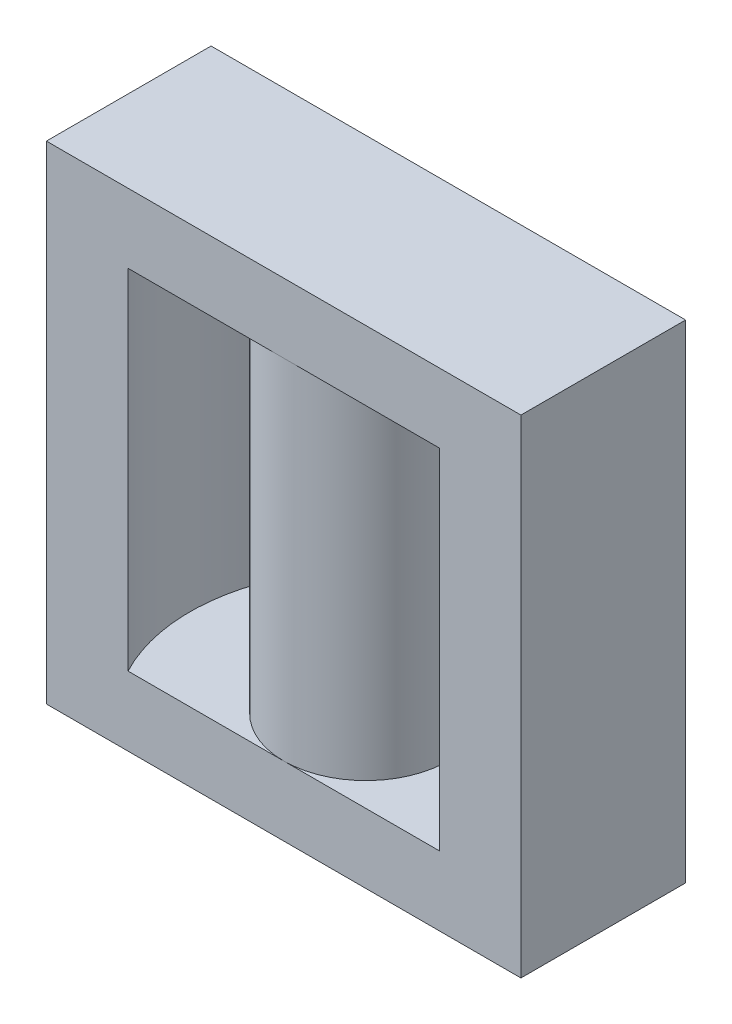
ISO-10303-21;
HEADER;
FILE_DESCRIPTION(('STEP AP214'),'2;1');
FILE_NAME('part.step','',(''),(''),'','','');
FILE_SCHEMA(('AUTOMOTIVE_DESIGN { 1 0 10303 214 1 1 1 1 }'));
ENDSEC;
DATA;
#1=APPLICATION_CONTEXT('core data for automotive mechanical design processes');
#2=APPLICATION_PROTOCOL_DEFINITION('international standard','automotive_design',2000,#1);
#3=PRODUCT_CONTEXT('',#1,'mechanical');
#4=PRODUCT('Part','Part','',(#3));
#5=PRODUCT_RELATED_PRODUCT_CATEGORY('part','',(#4));
#6=PRODUCT_DEFINITION_FORMATION('','',#4);
#7=PRODUCT_DEFINITION_CONTEXT('part definition',#1,'design');
#8=PRODUCT_DEFINITION('design','',#6,#7);
#9=PRODUCT_DEFINITION_SHAPE('','',#8);
#10=(LENGTH_UNIT() NAMED_UNIT(*) SI_UNIT(.MILLI.,.METRE.));
#11=(NAMED_UNIT(*) PLANE_ANGLE_UNIT() SI_UNIT($,.RADIAN.));
#12=(NAMED_UNIT(*) SI_UNIT($,.STERADIAN.) SOLID_ANGLE_UNIT());
#13=UNCERTAINTY_MEASURE_WITH_UNIT(LENGTH_MEASURE(1.E-05),#10,'distance_accuracy_value','');
#14=(GEOMETRIC_REPRESENTATION_CONTEXT(3) GLOBAL_UNCERTAINTY_ASSIGNED_CONTEXT((#13)) GLOBAL_UNIT_ASSIGNED_CONTEXT((#10,
#11,#12)) REPRESENTATION_CONTEXT('',''));
#15=CARTESIAN_POINT('',(0.,0.,0.));
#16=DIRECTION('',(0.,0.,1.));
#17=DIRECTION('',(1.,0.,0.));
#18=AXIS2_PLACEMENT_3D('',#15,#16,#17);
#19=CARTESIAN_POINT('',(-129.478947368421,45.,-367.005263157895));
#20=DIRECTION('',(0.,-1.,0.));
#21=DIRECTION('',(0.,0.,-1.));
#22=AXIS2_PLACEMENT_3D('',#19,#20,#21);
#23=CYLINDRICAL_SURFACE('',#22,16.25);
#24=DIRECTION('',(0.,-1.,0.));
#25=VECTOR('',#24,1.);
#26=CARTESIAN_POINT('',(-115.115713052989,45.,-359.405263157895));
#27=LINE('',#26,#25);
#28=CARTESIAN_POINT('',(-115.115713052989,38.6,-359.405263157895));
#29=VERTEX_POINT('',#28);
#30=CARTESIAN_POINT('',(-115.115713052989,6.4,-359.405263157895));
#31=VERTEX_POINT('',#30);
#32=EDGE_CURVE('E51',#29,#31,#27,.T.);
#33=ORIENTED_EDGE('',*,*,#32,.F.);
#34=CARTESIAN_POINT('',(-129.478947368421,38.6,-367.005263157895));
#35=DIRECTION('',(0.,1.,0.));
#36=DIRECTION('',(0.,0.,1.));
#37=AXIS2_PLACEMENT_3D('',#34,#35,#36);
#38=CIRCLE('',#37,16.25);
#39=CARTESIAN_POINT('',(-115.115713052989,38.6,-374.605263157895));
#40=VERTEX_POINT('',#39);
#41=EDGE_CURVE('E55',#29,#40,#38,.T.);
#42=ORIENTED_EDGE('',*,*,#41,.T.);
#43=DIRECTION('',(0.,-1.,0.));
#44=VECTOR('',#43,1.);
#45=CARTESIAN_POINT('',(-115.115713052989,45.,-374.605263157895));
#46=LINE('',#45,#44);
#47=CARTESIAN_POINT('',(-115.115713052989,6.4,-374.605263157895));
#48=VERTEX_POINT('',#47);
#49=EDGE_CURVE('E176',#40,#48,#46,.T.);
#50=ORIENTED_EDGE('',*,*,#49,.T.);
#51=CARTESIAN_POINT('',(-129.478947368421,6.4,-367.005263157895));
#52=DIRECTION('',(0.,1.,0.));
#53=DIRECTION('',(0.,0.,1.));
#54=AXIS2_PLACEMENT_3D('',#51,#52,#53);
#55=CIRCLE('',#54,16.25);
#56=EDGE_CURVE('E163',#31,#48,#55,.T.);
#57=ORIENTED_EDGE('',*,*,#56,.F.);
#58=EDGE_LOOP('',(#33,#42,#50,#57));
#59=FACE_BOUND('',#58,.T.);
#60=ADVANCED_FACE('F37',(#59),#23,.F.);
#61=CARTESIAN_POINT('',(-129.478947368421,45.,-367.005263157895));
#62=DIRECTION('',(0.,-1.,0.));
#63=DIRECTION('',(0.,0.,-1.));
#64=AXIS2_PLACEMENT_3D('',#61,#62,#63);
#65=CYLINDRICAL_SURFACE('',#64,7.59999999999999);
#66=CARTESIAN_POINT('',(-129.478947368421,6.4,-367.005263157895));
#67=DIRECTION('',(0.,1.,0.));
#68=DIRECTION('',(0.,0.,1.));
#69=AXIS2_PLACEMENT_3D('',#66,#67,#68);
#70=CIRCLE('',#69,7.59999999999999);
#71=CARTESIAN_POINT('',(-129.478947368421,6.4,-359.405263157895));
#72=VERTEX_POINT('',#71);
#73=CARTESIAN_POINT('',(-129.478947368421,6.4,-374.605263157895));
#74=VERTEX_POINT('',#73);
#75=EDGE_CURVE('E44',#72,#74,#70,.F.);
#76=ORIENTED_EDGE('',*,*,#75,.F.);
#77=EDGE_CURVE('E189',#74,#72,#70,.F.);
#78=ORIENTED_EDGE('',*,*,#77,.F.);
#79=EDGE_LOOP('',(#76,#78));
#80=FACE_BOUND('',#79,.T.);
#81=CARTESIAN_POINT('',(-129.478947368421,38.6,-367.005263157895));
#82=DIRECTION('',(0.,1.,0.));
#83=DIRECTION('',(0.,0.,1.));
#84=AXIS2_PLACEMENT_3D('',#81,#82,#83);
#85=CIRCLE('',#84,7.59999999999999);
#86=CARTESIAN_POINT('',(-129.478947368421,38.6,-359.405263157895));
#87=VERTEX_POINT('',#86);
#88=CARTESIAN_POINT('',(-129.478947368421,38.6,-374.605263157895));
#89=VERTEX_POINT('',#88);
#90=EDGE_CURVE('E109',#87,#89,#85,.T.);
#91=ORIENTED_EDGE('',*,*,#90,.F.);
#92=EDGE_CURVE('E112',#89,#87,#85,.T.);
#93=ORIENTED_EDGE('',*,*,#92,.F.);
#94=EDGE_LOOP('',(#91,#93));
#95=FACE_BOUND('',#94,.T.);
#96=ADVANCED_FACE('F111',(#80,#95),#65,.T.);
#97=CARTESIAN_POINT('',(-129.478947368421,45.,-367.005263157895));
#98=DIRECTION('',(0.,-1.,0.));
#99=DIRECTION('',(0.,0.,-1.));
#100=AXIS2_PLACEMENT_3D('',#97,#98,#99);
#101=CYLINDRICAL_SURFACE('',#100,16.25);
#102=DIRECTION('',(0.,-1.,0.));
#103=VECTOR('',#102,1.);
#104=CARTESIAN_POINT('',(-143.842181683853,45.,-374.605263157895));
#105=LINE('',#104,#103);
#106=CARTESIAN_POINT('',(-143.842181683853,38.6,-374.605263157895));
#107=VERTEX_POINT('',#106);
#108=CARTESIAN_POINT('',(-143.842181683853,6.4,-374.605263157895));
#109=VERTEX_POINT('',#108);
#110=EDGE_CURVE('E145',#107,#109,#105,.T.);
#111=ORIENTED_EDGE('',*,*,#110,.F.);
#112=CARTESIAN_POINT('',(-129.478947368421,38.6,-367.005263157895));
#113=DIRECTION('',(0.,1.,0.));
#114=DIRECTION('',(0.,0.,1.));
#115=AXIS2_PLACEMENT_3D('',#112,#113,#114);
#116=CIRCLE('',#115,16.25);
#117=CARTESIAN_POINT('',(-143.842181683853,38.6,-359.405263157895));
#118=VERTEX_POINT('',#117);
#119=EDGE_CURVE('E11',#107,#118,#116,.T.);
#120=ORIENTED_EDGE('',*,*,#119,.T.);
#121=DIRECTION('',(0.,-1.,0.));
#122=VECTOR('',#121,1.);
#123=CARTESIAN_POINT('',(-143.842181683853,45.,-359.405263157895));
#124=LINE('',#123,#122);
#125=CARTESIAN_POINT('',(-143.842181683853,6.40000000000002,-359.405263157895));
#126=VERTEX_POINT('',#125);
#127=EDGE_CURVE('E137',#118,#126,#124,.T.);
#128=ORIENTED_EDGE('',*,*,#127,.T.);
#129=CARTESIAN_POINT('',(-129.478947368421,6.4,-367.005263157895));
#130=DIRECTION('',(0.,1.,0.));
#131=DIRECTION('',(0.,0.,1.));
#132=AXIS2_PLACEMENT_3D('',#129,#130,#131);
#133=CIRCLE('',#132,16.25);
#134=EDGE_CURVE('E147',#126,#109,#133,.F.);
#135=ORIENTED_EDGE('',*,*,#134,.T.);
#136=EDGE_LOOP('',(#111,#120,#128,#135));
#137=FACE_BOUND('',#136,.T.);
#138=ADVANCED_FACE('F209',(#137),#101,.F.);
#139=CARTESIAN_POINT('',(0.,6.4,0.));
#140=DIRECTION('',(0.,1.,0.));
#141=DIRECTION('',(0.,0.,1.));
#142=AXIS2_PLACEMENT_3D('',#139,#140,#141);
#143=PLANE('',#142);
#144=ORIENTED_EDGE('',*,*,#134,.F.);
#145=DIRECTION('',(1.,0.,0.));
#146=VECTOR('',#145,1.);
#147=CARTESIAN_POINT('',(0.,6.4,-359.405263157895));
#148=LINE('',#147,#146);
#149=EDGE_CURVE('E151',#126,#72,#148,.T.);
#150=ORIENTED_EDGE('',*,*,#149,.T.);
#151=ORIENTED_EDGE('',*,*,#75,.T.);
#152=DIRECTION('',(1.,0.,0.));
#153=VECTOR('',#152,1.);
#154=CARTESIAN_POINT('',(0.,6.4,-374.605263157895));
#155=LINE('',#154,#153);
#156=EDGE_CURVE('E155',#109,#74,#155,.T.);
#157=ORIENTED_EDGE('',*,*,#156,.F.);
#158=EDGE_LOOP('',(#144,#150,#151,#157));
#159=FACE_BOUND('',#158,.T.);
#160=ADVANCED_FACE('F201',(#159),#143,.T.);
#161=CARTESIAN_POINT('',(0.,45.,-359.405263157895));
#162=DIRECTION('',(0.,0.,-1.));
#163=DIRECTION('',(-1.,0.,0.));
#164=AXIS2_PLACEMENT_3D('',#161,#162,#163);
#165=PLANE('',#164);
#166=DIRECTION('',(1.,0.,0.));
#167=VECTOR('',#166,1.);
#168=CARTESIAN_POINT('',(-151.378947368421,38.6,-359.405263157895));
#169=LINE('',#168,#167);
#170=EDGE_CURVE('E129',#87,#29,#169,.T.);
#171=ORIENTED_EDGE('',*,*,#170,.T.);
#172=ORIENTED_EDGE('',*,*,#32,.T.);
#173=EDGE_CURVE('E154',#72,#31,#148,.T.);
#174=ORIENTED_EDGE('',*,*,#173,.F.);
#175=ORIENTED_EDGE('',*,*,#149,.F.);
#176=ORIENTED_EDGE('',*,*,#127,.F.);
#177=EDGE_CURVE('E123',#118,#87,#169,.T.);
#178=ORIENTED_EDGE('',*,*,#177,.T.);
#179=EDGE_LOOP('',(#171,#172,#174,#175,#176,#178));
#180=FACE_BOUND('',#179,.T.);
#181=DIRECTION('',(1.,0.,0.));
#182=VECTOR('',#181,1.);
#183=CARTESIAN_POINT('',(0.,45.,-359.405263157895));
#184=LINE('',#183,#182);
#185=CARTESIAN_POINT('',(-151.378947368421,45.,-359.405263157895));
#186=VERTEX_POINT('',#185);
#187=CARTESIAN_POINT('',(-107.578947368421,45.,-359.405263157895));
#188=VERTEX_POINT('',#187);
#189=EDGE_CURVE('E167',#186,#188,#184,.T.);
#190=ORIENTED_EDGE('',*,*,#189,.F.);
#191=DIRECTION('',(0.,-1.,0.));
#192=VECTOR('',#191,1.);
#193=CARTESIAN_POINT('',(-151.378947368421,6.4,-359.405263157895));
#194=LINE('',#193,#192);
#195=CARTESIAN_POINT('',(-151.378947368421,0.,-359.405263157895));
#196=VERTEX_POINT('',#195);
#197=EDGE_CURVE('E157',#186,#196,#194,.T.);
#198=ORIENTED_EDGE('',*,*,#197,.T.);
#199=DIRECTION('',(1.,0.,0.));
#200=VECTOR('',#199,1.);
#201=CARTESIAN_POINT('',(0.,0.,-359.405263157895));
#202=LINE('',#201,#200);
#203=CARTESIAN_POINT('',(-107.578947368421,0.,-359.405263157895));
#204=VERTEX_POINT('',#203);
#205=EDGE_CURVE('E166',#196,#204,#202,.T.);
#206=ORIENTED_EDGE('',*,*,#205,.T.);
#207=DIRECTION('',(0.,-1.,0.));
#208=VECTOR('',#207,1.);
#209=CARTESIAN_POINT('',(-107.578947368421,45.,-359.405263157895));
#210=LINE('',#209,#208);
#211=EDGE_CURVE('E187',#188,#204,#210,.T.);
#212=ORIENTED_EDGE('',*,*,#211,.F.);
#213=EDGE_LOOP('',(#190,#198,#206,#212));
#214=FACE_BOUND('',#213,.T.);
#215=ADVANCED_FACE('F134',(#180,#214),#165,.F.);
#216=CARTESIAN_POINT('',(-107.578947368421,45.,0.));
#217=DIRECTION('',(1.,0.,0.));
#218=DIRECTION('',(0.,0.,-1.));
#219=AXIS2_PLACEMENT_3D('',#216,#217,#218);
#220=PLANE('',#219);
#221=ORIENTED_EDGE('',*,*,#211,.T.);
#222=DIRECTION('',(0.,0.,1.));
#223=VECTOR('',#222,1.);
#224=CARTESIAN_POINT('',(-107.578947368421,0.,0.));
#225=LINE('',#224,#223);
#226=CARTESIAN_POINT('',(-107.578947368421,0.,-374.605263157895));
#227=VERTEX_POINT('',#226);
#228=EDGE_CURVE('E179',#227,#204,#225,.T.);
#229=ORIENTED_EDGE('',*,*,#228,.F.);
#230=DIRECTION('',(0.,-1.,0.));
#231=VECTOR('',#230,1.);
#232=CARTESIAN_POINT('',(-107.578947368421,45.,-374.605263157895));
#233=LINE('',#232,#231);
#234=CARTESIAN_POINT('',(-107.578947368421,45.,-374.605263157895));
#235=VERTEX_POINT('',#234);
#236=EDGE_CURVE('E185',#235,#227,#233,.T.);
#237=ORIENTED_EDGE('',*,*,#236,.F.);
#238=DIRECTION('',(0.,0.,1.));
#239=VECTOR('',#238,1.);
#240=CARTESIAN_POINT('',(-107.578947368421,45.,0.));
#241=LINE('',#240,#239);
#242=EDGE_CURVE('E169',#235,#188,#241,.T.);
#243=ORIENTED_EDGE('',*,*,#242,.T.);
#244=EDGE_LOOP('',(#221,#229,#237,#243));
#245=FACE_BOUND('',#244,.T.);
#246=ADVANCED_FACE('F235',(#245),#220,.T.);
#247=CARTESIAN_POINT('',(0.,45.,-374.605263157895));
#248=DIRECTION('',(0.,0.,-1.));
#249=DIRECTION('',(-1.,0.,0.));
#250=AXIS2_PLACEMENT_3D('',#247,#248,#249);
#251=PLANE('',#250);
#252=ORIENTED_EDGE('',*,*,#49,.F.);
#253=DIRECTION('',(-1.,0.,0.));
#254=VECTOR('',#253,1.);
#255=CARTESIAN_POINT('',(-151.378947368421,38.6,-374.605263157895));
#256=LINE('',#255,#254);
#257=EDGE_CURVE('E127',#40,#89,#256,.T.);
#258=ORIENTED_EDGE('',*,*,#257,.T.);
#259=EDGE_CURVE('E125',#89,#107,#256,.T.);
#260=ORIENTED_EDGE('',*,*,#259,.T.);
#261=ORIENTED_EDGE('',*,*,#110,.T.);
#262=ORIENTED_EDGE('',*,*,#156,.T.);
#263=EDGE_CURVE('E153',#74,#48,#155,.T.);
#264=ORIENTED_EDGE('',*,*,#263,.T.);
#265=EDGE_LOOP('',(#252,#258,#260,#261,#262,#264));
#266=FACE_BOUND('',#265,.T.);
#267=ORIENTED_EDGE('',*,*,#236,.T.);
#268=DIRECTION('',(1.,0.,0.));
#269=VECTOR('',#268,1.);
#270=CARTESIAN_POINT('',(0.,0.,-374.605263157895));
#271=LINE('',#270,#269);
#272=CARTESIAN_POINT('',(-151.378947368421,0.,-374.605263157895));
#273=VERTEX_POINT('',#272);
#274=EDGE_CURVE('E170',#273,#227,#271,.T.);
#275=ORIENTED_EDGE('',*,*,#274,.F.);
#276=DIRECTION('',(0.,-1.,0.));
#277=VECTOR('',#276,1.);
#278=CARTESIAN_POINT('',(-151.378947368421,6.4,-374.605263157895));
#279=LINE('',#278,#277);
#280=CARTESIAN_POINT('',(-151.378947368421,45.,-374.605263157895));
#281=VERTEX_POINT('',#280);
#282=EDGE_CURVE('E161',#281,#273,#279,.T.);
#283=ORIENTED_EDGE('',*,*,#282,.F.);
#284=DIRECTION('',(1.,0.,0.));
#285=VECTOR('',#284,1.);
#286=CARTESIAN_POINT('',(0.,45.,-374.605263157895));
#287=LINE('',#286,#285);
#288=EDGE_CURVE('E173',#281,#235,#287,.T.);
#289=ORIENTED_EDGE('',*,*,#288,.T.);
#290=EDGE_LOOP('',(#267,#275,#283,#289));
#291=FACE_BOUND('',#290,.T.);
#292=ADVANCED_FACE('F206',(#266,#291),#251,.T.);
#293=CARTESIAN_POINT('',(0.,45.,0.));
#294=DIRECTION('',(0.,1.,0.));
#295=DIRECTION('',(0.,0.,1.));
#296=AXIS2_PLACEMENT_3D('',#293,#294,#295);
#297=PLANE('',#296);
#298=ORIENTED_EDGE('',*,*,#288,.F.);
#299=DIRECTION('',(0.,0.,1.));
#300=VECTOR('',#299,1.);
#301=CARTESIAN_POINT('',(-151.378947368418,45.,1.10568679481538E-12));
#302=LINE('',#301,#300);
#303=EDGE_CURVE('E141',#281,#186,#302,.T.);
#304=ORIENTED_EDGE('',*,*,#303,.T.);
#305=ORIENTED_EDGE('',*,*,#189,.T.);
#306=ORIENTED_EDGE('',*,*,#242,.F.);
#307=EDGE_LOOP('',(#298,#304,#305,#306));
#308=FACE_BOUND('',#307,.T.);
#309=ADVANCED_FACE('F226',(#308),#297,.T.);
#310=CARTESIAN_POINT('',(0.,0.,0.));
#311=DIRECTION('',(0.,1.,0.));
#312=DIRECTION('',(0.,0.,1.));
#313=AXIS2_PLACEMENT_3D('',#310,#311,#312);
#314=PLANE('',#313);
#315=ORIENTED_EDGE('',*,*,#228,.T.);
#316=ORIENTED_EDGE('',*,*,#205,.F.);
#317=DIRECTION('',(0.,0.,1.));
#318=VECTOR('',#317,1.);
#319=CARTESIAN_POINT('',(-151.378947368418,0.,1.10568679481538E-12));
#320=LINE('',#319,#318);
#321=EDGE_CURVE('E150',#273,#196,#320,.T.);
#322=ORIENTED_EDGE('',*,*,#321,.F.);
#323=ORIENTED_EDGE('',*,*,#274,.T.);
#324=EDGE_LOOP('',(#315,#316,#322,#323));
#325=FACE_BOUND('',#324,.T.);
#326=ADVANCED_FACE('F224',(#325),#314,.F.);
#327=CARTESIAN_POINT('',(-151.378947368418,6.4,1.10568679481538E-12));
#328=DIRECTION('',(1.,0.,0.));
#329=DIRECTION('',(0.,0.,-1.));
#330=AXIS2_PLACEMENT_3D('',#327,#328,#329);
#331=PLANE('',#330);
#332=ORIENTED_EDGE('',*,*,#282,.T.);
#333=ORIENTED_EDGE('',*,*,#321,.T.);
#334=ORIENTED_EDGE('',*,*,#197,.F.);
#335=ORIENTED_EDGE('',*,*,#303,.F.);
#336=EDGE_LOOP('',(#332,#333,#334,#335));
#337=FACE_BOUND('',#336,.T.);
#338=ADVANCED_FACE('F221',(#337),#331,.F.);
#339=ORIENTED_EDGE('',*,*,#263,.F.);
#340=ORIENTED_EDGE('',*,*,#77,.T.);
#341=ORIENTED_EDGE('',*,*,#173,.T.);
#342=ORIENTED_EDGE('',*,*,#56,.T.);
#343=EDGE_LOOP('',(#339,#340,#341,#342));
#344=FACE_BOUND('',#343,.T.);
#345=ADVANCED_FACE('F204',(#344),#143,.T.);
#346=CARTESIAN_POINT('',(0.,38.6,0.));
#347=DIRECTION('',(0.,1.,0.));
#348=DIRECTION('',(0.,0.,1.));
#349=AXIS2_PLACEMENT_3D('',#346,#347,#348);
#350=PLANE('',#349);
#351=ORIENTED_EDGE('',*,*,#41,.F.);
#352=ORIENTED_EDGE('',*,*,#170,.F.);
#353=ORIENTED_EDGE('',*,*,#90,.T.);
#354=ORIENTED_EDGE('',*,*,#257,.F.);
#355=EDGE_LOOP('',(#351,#352,#353,#354));
#356=FACE_BOUND('',#355,.T.);
#357=ADVANCED_FACE('F130',(#356),#350,.F.);
#358=ORIENTED_EDGE('',*,*,#259,.F.);
#359=ORIENTED_EDGE('',*,*,#92,.T.);
#360=ORIENTED_EDGE('',*,*,#177,.F.);
#361=ORIENTED_EDGE('',*,*,#119,.F.);
#362=EDGE_LOOP('',(#358,#359,#360,#361));
#363=FACE_BOUND('',#362,.T.);
#364=ADVANCED_FACE('F120',(#363),#350,.F.);
#365=CLOSED_SHELL('',(#60,#96,#138,#160,#215,#246,#292,#309,#326,#338,#345,#357,#364));
#366=MANIFOLD_SOLID_BREP('B2',#365);
#367=ADVANCED_BREP_SHAPE_REPRESENTATION('',(#18,#366),#14);
#368=SHAPE_DEFINITION_REPRESENTATION(#9,#367);
ENDSEC;
END-ISO-10303-21;
